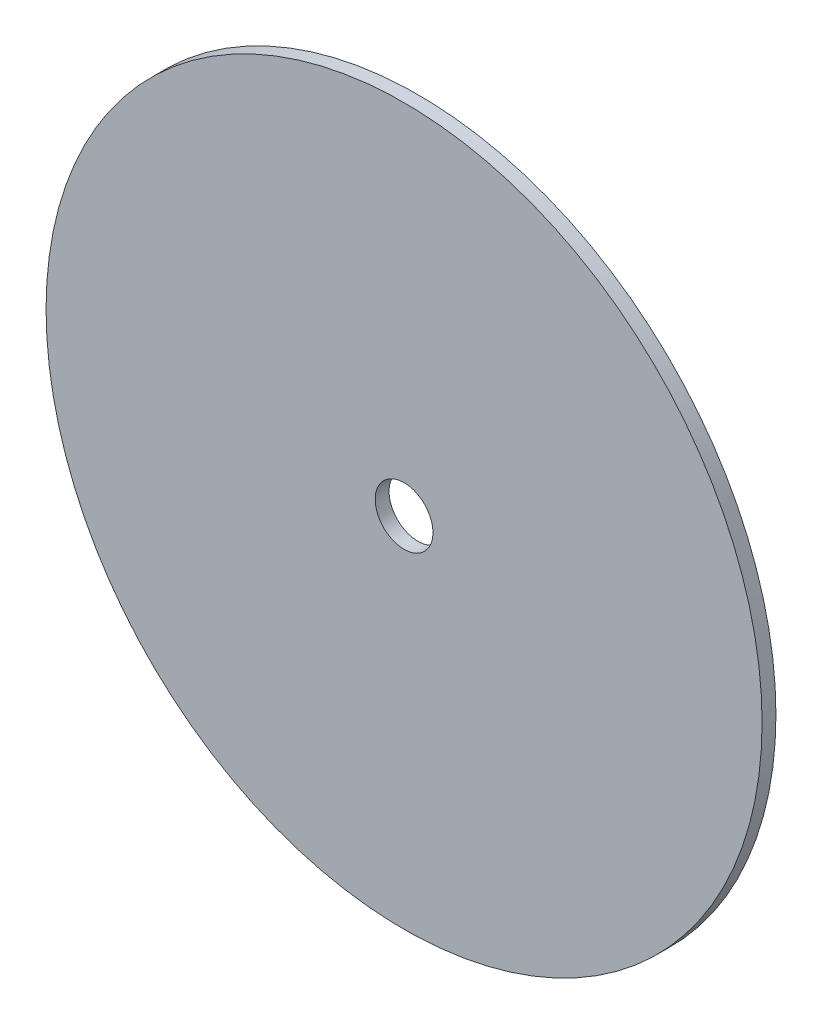
ISO-10303-21;
HEADER;
FILE_DESCRIPTION(('STEP AP214'),'2;1');
FILE_NAME('part.step','',(''),(''),'','','');
FILE_SCHEMA(('AUTOMOTIVE_DESIGN { 1 0 10303 214 1 1 1 1 }'));
ENDSEC;
DATA;
#1=APPLICATION_CONTEXT('core data for automotive mechanical design processes');
#2=APPLICATION_PROTOCOL_DEFINITION('international standard','automotive_design',2000,#1);
#3=PRODUCT_CONTEXT('',#1,'mechanical');
#4=PRODUCT('Part','Part','',(#3));
#5=PRODUCT_RELATED_PRODUCT_CATEGORY('part','',(#4));
#6=PRODUCT_DEFINITION_FORMATION('','',#4);
#7=PRODUCT_DEFINITION_CONTEXT('part definition',#1,'design');
#8=PRODUCT_DEFINITION('design','',#6,#7);
#9=PRODUCT_DEFINITION_SHAPE('','',#8);
#10=(LENGTH_UNIT() NAMED_UNIT(*) SI_UNIT(.MILLI.,.METRE.));
#11=(NAMED_UNIT(*) PLANE_ANGLE_UNIT() SI_UNIT($,.RADIAN.));
#12=(NAMED_UNIT(*) SI_UNIT($,.STERADIAN.) SOLID_ANGLE_UNIT());
#13=UNCERTAINTY_MEASURE_WITH_UNIT(LENGTH_MEASURE(1.E-05),#10,'distance_accuracy_value','');
#14=(GEOMETRIC_REPRESENTATION_CONTEXT(3) GLOBAL_UNCERTAINTY_ASSIGNED_CONTEXT((#13)) GLOBAL_UNIT_ASSIGNED_CONTEXT((#10,
#11,#12)) REPRESENTATION_CONTEXT('',''));
#15=CARTESIAN_POINT('',(0.,0.,0.));
#16=DIRECTION('',(0.,0.,1.));
#17=DIRECTION('',(1.,0.,0.));
#18=AXIS2_PLACEMENT_3D('',#15,#16,#17);
#19=CARTESIAN_POINT('',(0.,0.,6.));
#20=DIRECTION('',(0.,0.,1.));
#21=DIRECTION('',(1.,0.,0.));
#22=AXIS2_PLACEMENT_3D('',#19,#20,#21);
#23=PLANE('',#22);
#24=CARTESIAN_POINT('',(0.,0.,6.));
#25=DIRECTION('',(0.,0.,1.));
#26=DIRECTION('',(1.,0.,0.));
#27=AXIS2_PLACEMENT_3D('',#24,#25,#26);
#28=CIRCLE('',#27,155.);
#29=CARTESIAN_POINT('',(155.,0.,6.));
#30=VERTEX_POINT('',#29);
#31=EDGE_CURVE('E10',#30,#30,#28,.T.);
#32=ORIENTED_EDGE('',*,*,#31,.T.);
#33=EDGE_LOOP('',(#32));
#34=FACE_BOUND('',#33,.T.);
#35=CARTESIAN_POINT('',(0.,0.,6.));
#36=DIRECTION('',(0.,0.,1.));
#37=DIRECTION('',(1.,0.,0.));
#38=AXIS2_PLACEMENT_3D('',#35,#36,#37);
#39=CIRCLE('',#38,12.5);
#40=CARTESIAN_POINT('',(12.5,0.,6.));
#41=VERTEX_POINT('',#40);
#42=EDGE_CURVE('E50',#41,#41,#39,.T.);
#43=ORIENTED_EDGE('',*,*,#42,.F.);
#44=EDGE_LOOP('',(#43));
#45=FACE_BOUND('',#44,.T.);
#46=ADVANCED_FACE('F36',(#34,#45),#23,.T.);
#47=CARTESIAN_POINT('',(0.,0.,0.));
#48=DIRECTION('',(0.,0.,1.));
#49=DIRECTION('',(1.,0.,0.));
#50=AXIS2_PLACEMENT_3D('',#47,#48,#49);
#51=PLANE('',#50);
#52=CARTESIAN_POINT('',(0.,0.,0.));
#53=DIRECTION('',(0.,0.,1.));
#54=DIRECTION('',(1.,0.,0.));
#55=AXIS2_PLACEMENT_3D('',#52,#53,#54);
#56=CIRCLE('',#55,155.);
#57=CARTESIAN_POINT('',(155.,0.,0.));
#58=VERTEX_POINT('',#57);
#59=EDGE_CURVE('E40',#58,#58,#56,.T.);
#60=ORIENTED_EDGE('',*,*,#59,.F.);
#61=EDGE_LOOP('',(#60));
#62=FACE_BOUND('',#61,.T.);
#63=CARTESIAN_POINT('',(0.,0.,0.));
#64=DIRECTION('',(0.,0.,1.));
#65=DIRECTION('',(1.,0.,0.));
#66=AXIS2_PLACEMENT_3D('',#63,#64,#65);
#67=CIRCLE('',#66,12.5);
#68=CARTESIAN_POINT('',(12.5,0.,0.));
#69=VERTEX_POINT('',#68);
#70=EDGE_CURVE('E52',#69,#69,#67,.T.);
#71=ORIENTED_EDGE('',*,*,#70,.T.);
#72=EDGE_LOOP('',(#71));
#73=FACE_BOUND('',#72,.T.);
#74=ADVANCED_FACE('F65',(#62,#73),#51,.F.);
#75=CARTESIAN_POINT('',(0.,0.,6.));
#76=DIRECTION('',(0.,0.,-1.));
#77=DIRECTION('',(-1.,0.,0.));
#78=AXIS2_PLACEMENT_3D('',#75,#76,#77);
#79=CYLINDRICAL_SURFACE('',#78,155.);
#80=ORIENTED_EDGE('',*,*,#31,.F.);
#81=EDGE_LOOP('',(#80));
#82=FACE_BOUND('',#81,.T.);
#83=ORIENTED_EDGE('',*,*,#59,.T.);
#84=EDGE_LOOP('',(#83));
#85=FACE_BOUND('',#84,.T.);
#86=ADVANCED_FACE('F38',(#82,#85),#79,.T.);
#87=CARTESIAN_POINT('',(0.,0.,6.));
#88=DIRECTION('',(0.,0.,-1.));
#89=DIRECTION('',(-1.,0.,0.));
#90=AXIS2_PLACEMENT_3D('',#87,#88,#89);
#91=CYLINDRICAL_SURFACE('',#90,12.5);
#92=ORIENTED_EDGE('',*,*,#42,.T.);
#93=EDGE_LOOP('',(#92));
#94=FACE_BOUND('',#93,.T.);
#95=ORIENTED_EDGE('',*,*,#70,.F.);
#96=EDGE_LOOP('',(#95));
#97=FACE_BOUND('',#96,.T.);
#98=ADVANCED_FACE('F61',(#94,#97),#91,.F.);
#99=CLOSED_SHELL('',(#46,#74,#86,#98));
#100=MANIFOLD_SOLID_BREP('B2',#99);
#101=ADVANCED_BREP_SHAPE_REPRESENTATION('',(#18,#100),#14);
#102=SHAPE_DEFINITION_REPRESENTATION(#9,#101);
ENDSEC;
END-ISO-10303-21;
